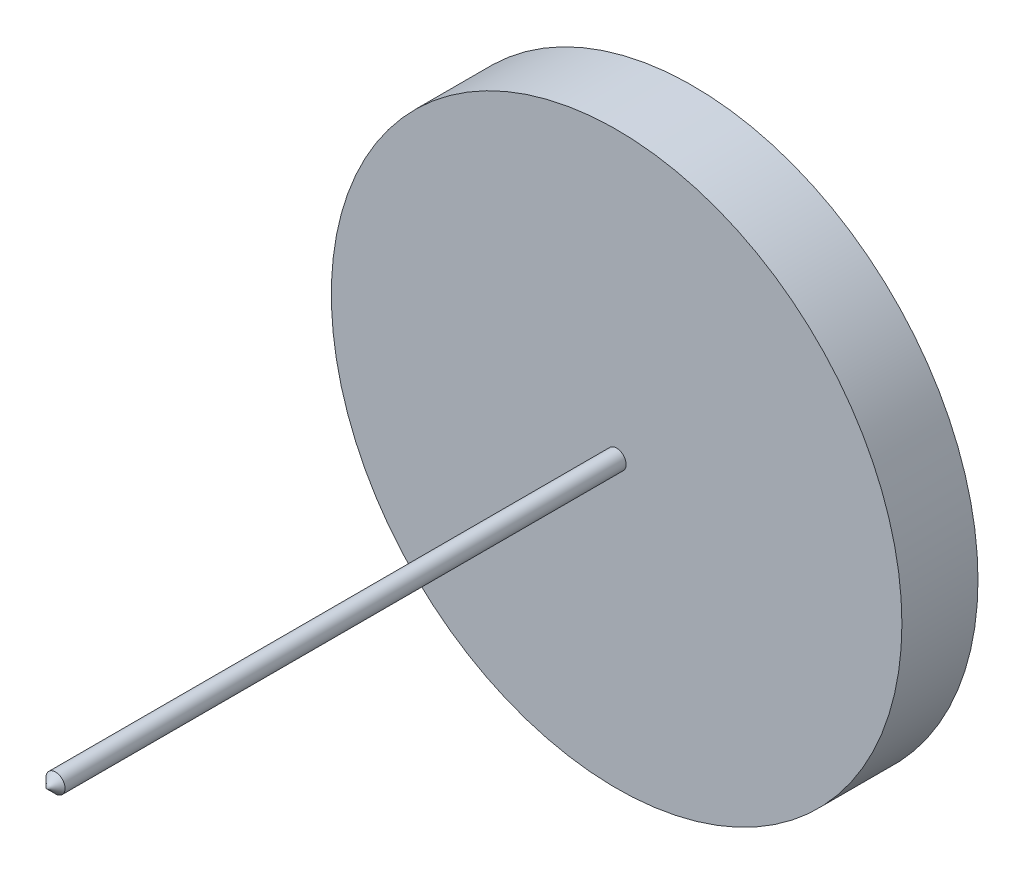
ISO-10303-21;
HEADER;
FILE_DESCRIPTION(('STEP AP214'),'2;1');
FILE_NAME('part.step','',(''),(''),'','','');
FILE_SCHEMA(('AUTOMOTIVE_DESIGN { 1 0 10303 214 1 1 1 1 }'));
ENDSEC;
DATA;
#1=APPLICATION_CONTEXT('core data for automotive mechanical design processes');
#2=APPLICATION_PROTOCOL_DEFINITION('international standard','automotive_design',2000,#1);
#3=PRODUCT_CONTEXT('',#1,'mechanical');
#4=PRODUCT('Part','Part','',(#3));
#5=PRODUCT_RELATED_PRODUCT_CATEGORY('part','',(#4));
#6=PRODUCT_DEFINITION_FORMATION('','',#4);
#7=PRODUCT_DEFINITION_CONTEXT('part definition',#1,'design');
#8=PRODUCT_DEFINITION('design','',#6,#7);
#9=PRODUCT_DEFINITION_SHAPE('','',#8);
#10=(LENGTH_UNIT() NAMED_UNIT(*) SI_UNIT(.MILLI.,.METRE.));
#11=(NAMED_UNIT(*) PLANE_ANGLE_UNIT() SI_UNIT($,.RADIAN.));
#12=(NAMED_UNIT(*) SI_UNIT($,.STERADIAN.) SOLID_ANGLE_UNIT());
#13=UNCERTAINTY_MEASURE_WITH_UNIT(LENGTH_MEASURE(1.E-05),#10,'distance_accuracy_value','');
#14=(GEOMETRIC_REPRESENTATION_CONTEXT(3) GLOBAL_UNCERTAINTY_ASSIGNED_CONTEXT((#13)) GLOBAL_UNIT_ASSIGNED_CONTEXT((#10,
#11,#12)) REPRESENTATION_CONTEXT('',''));
#15=CARTESIAN_POINT('',(0.,0.,0.));
#16=DIRECTION('',(0.,0.,1.));
#17=DIRECTION('',(1.,0.,0.));
#18=AXIS2_PLACEMENT_3D('',#15,#16,#17);
#19=CARTESIAN_POINT('',(0.,0.,2.));
#20=DIRECTION('',(0.,0.,-1.));
#21=DIRECTION('',(-1.,0.,0.));
#22=AXIS2_PLACEMENT_3D('',#19,#20,#21);
#23=CYLINDRICAL_SURFACE('',#22,7.5);
#24=CARTESIAN_POINT('',(0.,0.,2.));
#25=DIRECTION('',(0.,0.,1.));
#26=DIRECTION('',(1.,0.,0.));
#27=AXIS2_PLACEMENT_3D('',#24,#25,#26);
#28=CIRCLE('',#27,7.5);
#29=CARTESIAN_POINT('',(7.5,0.,2.));
#30=VERTEX_POINT('',#29);
#31=EDGE_CURVE('E46',#30,#30,#28,.T.);
#32=ORIENTED_EDGE('',*,*,#31,.F.);
#33=EDGE_LOOP('',(#32));
#34=FACE_BOUND('',#33,.T.);
#35=CARTESIAN_POINT('',(0.,0.,0.));
#36=DIRECTION('',(0.,0.,1.));
#37=DIRECTION('',(1.,0.,0.));
#38=AXIS2_PLACEMENT_3D('',#35,#36,#37);
#39=CIRCLE('',#38,7.5);
#40=CARTESIAN_POINT('',(7.5,0.,0.));
#41=VERTEX_POINT('',#40);
#42=EDGE_CURVE('E76',#41,#41,#39,.T.);
#43=ORIENTED_EDGE('',*,*,#42,.T.);
#44=EDGE_LOOP('',(#43));
#45=FACE_BOUND('',#44,.T.);
#46=ADVANCED_FACE('F38',(#34,#45),#23,.T.);
#47=CARTESIAN_POINT('',(0.,0.,2.));
#48=DIRECTION('',(0.,0.,1.));
#49=DIRECTION('',(1.,0.,0.));
#50=AXIS2_PLACEMENT_3D('',#47,#48,#49);
#51=PLANE('',#50);
#52=CARTESIAN_POINT('',(0.,0.,2.));
#53=DIRECTION('',(0.,0.,1.));
#54=DIRECTION('',(1.,0.,0.));
#55=AXIS2_PLACEMENT_3D('',#52,#53,#54);
#56=CIRCLE('',#55,0.25);
#57=CARTESIAN_POINT('',(0.25,0.,2.));
#58=VERTEX_POINT('',#57);
#59=EDGE_CURVE('E77',#58,#58,#56,.T.);
#60=ORIENTED_EDGE('',*,*,#59,.F.);
#61=EDGE_LOOP('',(#60));
#62=FACE_BOUND('',#61,.T.);
#63=ORIENTED_EDGE('',*,*,#31,.T.);
#64=EDGE_LOOP('',(#63));
#65=FACE_BOUND('',#64,.T.);
#66=ADVANCED_FACE('F60',(#62,#65),#51,.T.);
#67=CARTESIAN_POINT('',(0.,0.,0.));
#68=DIRECTION('',(0.,0.,1.));
#69=DIRECTION('',(1.,0.,0.));
#70=AXIS2_PLACEMENT_3D('',#67,#68,#69);
#71=PLANE('',#70);
#72=ORIENTED_EDGE('',*,*,#42,.F.);
#73=EDGE_LOOP('',(#72));
#74=FACE_BOUND('',#73,.T.);
#75=ADVANCED_FACE('F55',(#74),#71,.F.);
#76=CARTESIAN_POINT('',(0.,0.,17.));
#77=DIRECTION('',(0.,0.,-1.));
#78=DIRECTION('',(-1.,0.,0.));
#79=AXIS2_PLACEMENT_3D('',#76,#77,#78);
#80=CYLINDRICAL_SURFACE('',#79,0.25);
#81=CARTESIAN_POINT('',(0.,0.,16.75));
#82=DIRECTION('',(0.,0.,1.));
#83=DIRECTION('',(1.,0.,0.));
#84=AXIS2_PLACEMENT_3D('',#81,#82,#83);
#85=CIRCLE('',#84,0.25);
#86=CARTESIAN_POINT('',(0.25,0.,16.75));
#87=VERTEX_POINT('',#86);
#88=EDGE_CURVE('E11',#87,#87,#85,.F.);
#89=ORIENTED_EDGE('',*,*,#88,.T.);
#90=EDGE_LOOP('',(#89));
#91=FACE_BOUND('',#90,.T.);
#92=ORIENTED_EDGE('',*,*,#59,.T.);
#93=EDGE_LOOP('',(#92));
#94=FACE_BOUND('',#93,.T.);
#95=ADVANCED_FACE('F50',(#91,#94),#80,.T.);
#96=CARTESIAN_POINT('',(0.,0.,16.75));
#97=DIRECTION('',(0.,0.,-1.));
#98=DIRECTION('',(-1.,0.,0.));
#99=AXIS2_PLACEMENT_3D('',#96,#97,#98);
#100=CONICAL_SURFACE('',#99,0.25,0.785398163397448);
#101=ORIENTED_EDGE('',*,*,#88,.F.);
#102=EDGE_LOOP('',(#101));
#103=FACE_BOUND('',#102,.T.);
#104=CARTESIAN_POINT('',(0.,0.,17.));
#105=VERTEX_POINT('',#104);
#106=VERTEX_LOOP('',#105);
#107=FACE_BOUND('',#106,.T.);
#108=ADVANCED_FACE('F41',(#103,#107),#100,.T.);
#109=CLOSED_SHELL('',(#46,#66,#75,#95,#108));
#110=MANIFOLD_SOLID_BREP('B2',#109);
#111=ADVANCED_BREP_SHAPE_REPRESENTATION('',(#18,#110),#14);
#112=SHAPE_DEFINITION_REPRESENTATION(#9,#111);
ENDSEC;
END-ISO-10303-21;
